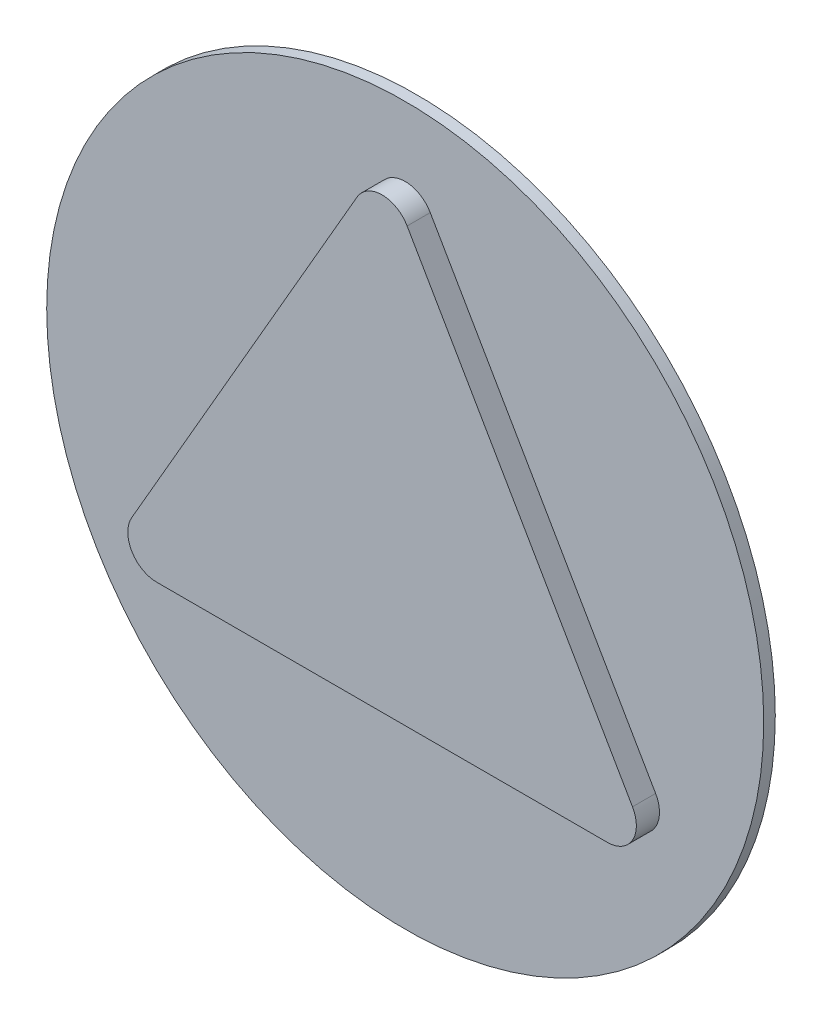
ISO-10303-21;
HEADER;
FILE_DESCRIPTION(('STEP AP214'),'2;1');
FILE_NAME('part.step','',(''),(''),'','','');
FILE_SCHEMA(('AUTOMOTIVE_DESIGN { 1 0 10303 214 1 1 1 1 }'));
ENDSEC;
DATA;
#1=APPLICATION_CONTEXT('core data for automotive mechanical design processes');
#2=APPLICATION_PROTOCOL_DEFINITION('international standard','automotive_design',2000,#1);
#3=PRODUCT_CONTEXT('',#1,'mechanical');
#4=PRODUCT('Part','Part','',(#3));
#5=PRODUCT_RELATED_PRODUCT_CATEGORY('part','',(#4));
#6=PRODUCT_DEFINITION_FORMATION('','',#4);
#7=PRODUCT_DEFINITION_CONTEXT('part definition',#1,'design');
#8=PRODUCT_DEFINITION('design','',#6,#7);
#9=PRODUCT_DEFINITION_SHAPE('','',#8);
#10=(LENGTH_UNIT() NAMED_UNIT(*) SI_UNIT(.MILLI.,.METRE.));
#11=(NAMED_UNIT(*) PLANE_ANGLE_UNIT() SI_UNIT($,.RADIAN.));
#12=(NAMED_UNIT(*) SI_UNIT($,.STERADIAN.) SOLID_ANGLE_UNIT());
#13=UNCERTAINTY_MEASURE_WITH_UNIT(LENGTH_MEASURE(1.E-05),#10,'distance_accuracy_value','');
#14=(GEOMETRIC_REPRESENTATION_CONTEXT(3) GLOBAL_UNCERTAINTY_ASSIGNED_CONTEXT((#13)) GLOBAL_UNIT_ASSIGNED_CONTEXT((#10,
#11,#12)) REPRESENTATION_CONTEXT('',''));
#15=CARTESIAN_POINT('',(0.,0.,0.));
#16=DIRECTION('',(0.,0.,1.));
#17=DIRECTION('',(1.,0.,0.));
#18=AXIS2_PLACEMENT_3D('',#15,#16,#17);
#19=CARTESIAN_POINT('',(0.,0.,0.5));
#20=DIRECTION('',(0.,0.,-1.));
#21=DIRECTION('',(-1.,0.,0.));
#22=AXIS2_PLACEMENT_3D('',#19,#20,#21);
#23=CYLINDRICAL_SURFACE('',#22,15.5);
#24=CARTESIAN_POINT('',(0.,0.,0.5));
#25=DIRECTION('',(0.,0.,1.));
#26=DIRECTION('',(1.,0.,0.));
#27=AXIS2_PLACEMENT_3D('',#24,#25,#26);
#28=CIRCLE('',#27,15.5);
#29=CARTESIAN_POINT('',(15.5,0.,0.5));
#30=VERTEX_POINT('',#29);
#31=EDGE_CURVE('E119',#30,#30,#28,.T.);
#32=ORIENTED_EDGE('',*,*,#31,.F.);
#33=EDGE_LOOP('',(#32));
#34=FACE_BOUND('',#33,.T.);
#35=CARTESIAN_POINT('',(0.,0.,0.));
#36=DIRECTION('',(0.,0.,1.));
#37=DIRECTION('',(1.,0.,0.));
#38=AXIS2_PLACEMENT_3D('',#35,#36,#37);
#39=CIRCLE('',#38,15.5);
#40=CARTESIAN_POINT('',(15.5,0.,0.));
#41=VERTEX_POINT('',#40);
#42=EDGE_CURVE('E122',#41,#41,#39,.T.);
#43=ORIENTED_EDGE('',*,*,#42,.T.);
#44=EDGE_LOOP('',(#43));
#45=FACE_BOUND('',#44,.T.);
#46=ADVANCED_FACE('F35',(#34,#45),#23,.T.);
#47=CARTESIAN_POINT('',(0.,0.,0.5));
#48=DIRECTION('',(0.,0.,1.));
#49=DIRECTION('',(1.,0.,0.));
#50=AXIS2_PLACEMENT_3D('',#47,#48,#49);
#51=PLANE('',#50);
#52=DIRECTION('',(-0.5,-0.866025403784439,0.));
#53=VECTOR('',#52,1.);
#54=CARTESIAN_POINT('',(0.,13.75,0.5));
#55=LINE('',#54,#53);
#56=CARTESIAN_POINT('',(-1.08253175473055,11.875,0.5));
#57=VERTEX_POINT('',#56);
#58=CARTESIAN_POINT('',(-10.8253175473055,-5.,0.5));
#59=VERTEX_POINT('',#58);
#60=EDGE_CURVE('E115',#57,#59,#55,.T.);
#61=ORIENTED_EDGE('',*,*,#60,.F.);
#62=CARTESIAN_POINT('',(0.,11.25,0.5));
#63=DIRECTION('',(0.,0.,1.));
#64=DIRECTION('',(1.,0.,0.));
#65=AXIS2_PLACEMENT_3D('',#62,#63,#64);
#66=CIRCLE('',#65,1.25);
#67=CARTESIAN_POINT('',(1.08253175473054,11.875,0.5));
#68=VERTEX_POINT('',#67);
#69=EDGE_CURVE('E11',#57,#68,#66,.F.);
#70=ORIENTED_EDGE('',*,*,#69,.T.);
#71=DIRECTION('',(-0.5,0.866025403784438,0.));
#72=VECTOR('',#71,1.);
#73=CARTESIAN_POINT('',(11.907849302036,-6.875,0.5));
#74=LINE('',#73,#72);
#75=CARTESIAN_POINT('',(10.8253175473055,-5.,0.5));
#76=VERTEX_POINT('',#75);
#77=EDGE_CURVE('E101',#76,#68,#74,.T.);
#78=ORIENTED_EDGE('',*,*,#77,.F.);
#79=CARTESIAN_POINT('',(9.74278579257494,-5.625,0.5));
#80=DIRECTION('',(0.,0.,1.));
#81=DIRECTION('',(1.,0.,0.));
#82=AXIS2_PLACEMENT_3D('',#79,#80,#81);
#83=CIRCLE('',#82,1.25);
#84=CARTESIAN_POINT('',(9.74278579257493,-6.875,0.5));
#85=VERTEX_POINT('',#84);
#86=EDGE_CURVE('E87',#76,#85,#83,.F.);
#87=ORIENTED_EDGE('',*,*,#86,.T.);
#88=DIRECTION('',(1.,0.,0.));
#89=VECTOR('',#88,1.);
#90=CARTESIAN_POINT('',(-11.907849302036,-6.875,0.5));
#91=LINE('',#90,#89);
#92=CARTESIAN_POINT('',(-9.74278579257493,-6.875,0.5));
#93=VERTEX_POINT('',#92);
#94=EDGE_CURVE('E110',#93,#85,#91,.T.);
#95=ORIENTED_EDGE('',*,*,#94,.F.);
#96=CARTESIAN_POINT('',(-9.74278579257493,-5.625,0.5));
#97=DIRECTION('',(0.,0.,1.));
#98=DIRECTION('',(1.,0.,0.));
#99=AXIS2_PLACEMENT_3D('',#96,#97,#98);
#100=CIRCLE('',#99,1.25);
#101=EDGE_CURVE('E43',#93,#59,#100,.F.);
#102=ORIENTED_EDGE('',*,*,#101,.T.);
#103=EDGE_LOOP('',(#61,#70,#78,#87,#95,#102));
#104=FACE_BOUND('',#103,.T.);
#105=ORIENTED_EDGE('',*,*,#31,.T.);
#106=EDGE_LOOP('',(#105));
#107=FACE_BOUND('',#106,.T.);
#108=ADVANCED_FACE('F107',(#104,#107),#51,.T.);
#109=CARTESIAN_POINT('',(0.,0.,0.));
#110=DIRECTION('',(0.,0.,1.));
#111=DIRECTION('',(1.,0.,0.));
#112=AXIS2_PLACEMENT_3D('',#109,#110,#111);
#113=PLANE('',#112);
#114=ORIENTED_EDGE('',*,*,#42,.F.);
#115=EDGE_LOOP('',(#114));
#116=FACE_BOUND('',#115,.T.);
#117=ADVANCED_FACE('F164',(#116),#113,.F.);
#118=CARTESIAN_POINT('',(0.,13.75,1.5));
#119=DIRECTION('',(0.866025403784439,-0.5,0.));
#120=DIRECTION('',(0.5,0.866025403784439,0.));
#121=AXIS2_PLACEMENT_3D('',#118,#119,#120);
#122=PLANE('',#121);
#123=ORIENTED_EDGE('',*,*,#60,.T.);
#124=DIRECTION('',(0.,0.,-1.));
#125=VECTOR('',#124,1.);
#126=CARTESIAN_POINT('',(-10.8253175473055,-5.,1.5));
#127=LINE('',#126,#125);
#128=CARTESIAN_POINT('',(-10.8253175473055,-5.,1.5));
#129=VERTEX_POINT('',#128);
#130=EDGE_CURVE('E95',#59,#129,#127,.F.);
#131=ORIENTED_EDGE('',*,*,#130,.T.);
#132=DIRECTION('',(-0.5,-0.866025403784439,0.));
#133=VECTOR('',#132,1.);
#134=CARTESIAN_POINT('',(0.,13.75,1.5));
#135=LINE('',#134,#133);
#136=CARTESIAN_POINT('',(-1.08253175473055,11.875,1.5));
#137=VERTEX_POINT('',#136);
#138=EDGE_CURVE('E109',#137,#129,#135,.T.);
#139=ORIENTED_EDGE('',*,*,#138,.F.);
#140=DIRECTION('',(0.,0.,-1.));
#141=VECTOR('',#140,1.);
#142=CARTESIAN_POINT('',(-1.08253175473055,11.875,1.5));
#143=LINE('',#142,#141);
#144=EDGE_CURVE('E135',#137,#57,#143,.T.);
#145=ORIENTED_EDGE('',*,*,#144,.T.);
#146=EDGE_LOOP('',(#123,#131,#139,#145));
#147=FACE_BOUND('',#146,.T.);
#148=ADVANCED_FACE('F140',(#147),#122,.F.);
#149=CARTESIAN_POINT('',(-11.907849302036,-6.875,1.5));
#150=DIRECTION('',(0.,1.,0.));
#151=DIRECTION('',(0.,0.,1.));
#152=AXIS2_PLACEMENT_3D('',#149,#150,#151);
#153=PLANE('',#152);
#154=ORIENTED_EDGE('',*,*,#94,.T.);
#155=DIRECTION('',(0.,0.,-1.));
#156=VECTOR('',#155,1.);
#157=CARTESIAN_POINT('',(9.74278579257494,-6.875,1.5));
#158=LINE('',#157,#156);
#159=CARTESIAN_POINT('',(9.74278579257493,-6.875,1.5));
#160=VERTEX_POINT('',#159);
#161=EDGE_CURVE('E92',#85,#160,#158,.F.);
#162=ORIENTED_EDGE('',*,*,#161,.T.);
#163=DIRECTION('',(1.,0.,0.));
#164=VECTOR('',#163,1.);
#165=CARTESIAN_POINT('',(-11.907849302036,-6.875,1.5));
#166=LINE('',#165,#164);
#167=CARTESIAN_POINT('',(-9.74278579257493,-6.875,1.5));
#168=VERTEX_POINT('',#167);
#169=EDGE_CURVE('E113',#168,#160,#166,.T.);
#170=ORIENTED_EDGE('',*,*,#169,.F.);
#171=DIRECTION('',(0.,0.,-1.));
#172=VECTOR('',#171,1.);
#173=CARTESIAN_POINT('',(-9.74278579257493,-6.875,1.5));
#174=LINE('',#173,#172);
#175=EDGE_CURVE('E104',#168,#93,#174,.T.);
#176=ORIENTED_EDGE('',*,*,#175,.T.);
#177=EDGE_LOOP('',(#154,#162,#170,#176));
#178=FACE_BOUND('',#177,.T.);
#179=ADVANCED_FACE('F151',(#178),#153,.F.);
#180=CARTESIAN_POINT('',(11.907849302036,-6.875,1.5));
#181=DIRECTION('',(-0.866025403784439,-0.5,0.));
#182=DIRECTION('',(0.5,-0.866025403784438,0.));
#183=AXIS2_PLACEMENT_3D('',#180,#181,#182);
#184=PLANE('',#183);
#185=DIRECTION('',(-0.5,0.866025403784438,0.));
#186=VECTOR('',#185,1.);
#187=CARTESIAN_POINT('',(11.907849302036,-6.875,1.5));
#188=LINE('',#187,#186);
#189=CARTESIAN_POINT('',(10.8253175473055,-5.,1.5));
#190=VERTEX_POINT('',#189);
#191=CARTESIAN_POINT('',(1.08253175473054,11.875,1.5));
#192=VERTEX_POINT('',#191);
#193=EDGE_CURVE('E103',#190,#192,#188,.T.);
#194=ORIENTED_EDGE('',*,*,#193,.F.);
#195=DIRECTION('',(0.,0.,-1.));
#196=VECTOR('',#195,1.);
#197=CARTESIAN_POINT('',(10.8253175473055,-5.,1.5));
#198=LINE('',#197,#196);
#199=EDGE_CURVE('E91',#190,#76,#198,.T.);
#200=ORIENTED_EDGE('',*,*,#199,.T.);
#201=ORIENTED_EDGE('',*,*,#77,.T.);
#202=DIRECTION('',(0.,0.,-1.));
#203=VECTOR('',#202,1.);
#204=CARTESIAN_POINT('',(1.08253175473054,11.875,1.5));
#205=LINE('',#204,#203);
#206=EDGE_CURVE('E105',#68,#192,#205,.F.);
#207=ORIENTED_EDGE('',*,*,#206,.T.);
#208=EDGE_LOOP('',(#194,#200,#201,#207));
#209=FACE_BOUND('',#208,.T.);
#210=ADVANCED_FACE('F100',(#209),#184,.F.);
#211=CARTESIAN_POINT('',(0.,0.,1.5));
#212=DIRECTION('',(0.,0.,1.));
#213=DIRECTION('',(1.,0.,0.));
#214=AXIS2_PLACEMENT_3D('',#211,#212,#213);
#215=PLANE('',#214);
#216=ORIENTED_EDGE('',*,*,#169,.T.);
#217=CARTESIAN_POINT('',(9.74278579257494,-5.625,1.5));
#218=DIRECTION('',(0.,0.,1.));
#219=DIRECTION('',(1.,0.,0.));
#220=AXIS2_PLACEMENT_3D('',#217,#218,#219);
#221=CIRCLE('',#220,1.25);
#222=EDGE_CURVE('E133',#160,#190,#221,.T.);
#223=ORIENTED_EDGE('',*,*,#222,.T.);
#224=ORIENTED_EDGE('',*,*,#193,.T.);
#225=CARTESIAN_POINT('',(0.,11.25,1.5));
#226=DIRECTION('',(0.,0.,1.));
#227=DIRECTION('',(1.,0.,0.));
#228=AXIS2_PLACEMENT_3D('',#225,#226,#227);
#229=CIRCLE('',#228,1.25);
#230=EDGE_CURVE('E129',#192,#137,#229,.T.);
#231=ORIENTED_EDGE('',*,*,#230,.T.);
#232=ORIENTED_EDGE('',*,*,#138,.T.);
#233=CARTESIAN_POINT('',(-9.74278579257493,-5.625,1.5));
#234=DIRECTION('',(0.,0.,1.));
#235=DIRECTION('',(1.,0.,0.));
#236=AXIS2_PLACEMENT_3D('',#233,#234,#235);
#237=CIRCLE('',#236,1.25);
#238=EDGE_CURVE('E131',#129,#168,#237,.T.);
#239=ORIENTED_EDGE('',*,*,#238,.T.);
#240=EDGE_LOOP('',(#216,#223,#224,#231,#232,#239));
#241=FACE_BOUND('',#240,.T.);
#242=ADVANCED_FACE('F145',(#241),#215,.T.);
#243=CARTESIAN_POINT('',(9.74278579257494,-5.625,1.5));
#244=DIRECTION('',(0.,0.,-1.));
#245=DIRECTION('',(-1.,0.,0.));
#246=AXIS2_PLACEMENT_3D('',#243,#244,#245);
#247=CYLINDRICAL_SURFACE('',#246,1.25);
#248=ORIENTED_EDGE('',*,*,#222,.F.);
#249=ORIENTED_EDGE('',*,*,#161,.F.);
#250=ORIENTED_EDGE('',*,*,#86,.F.);
#251=ORIENTED_EDGE('',*,*,#199,.F.);
#252=EDGE_LOOP('',(#248,#249,#250,#251));
#253=FACE_BOUND('',#252,.T.);
#254=ADVANCED_FACE('F90',(#253),#247,.T.);
#255=CARTESIAN_POINT('',(-9.74278579257493,-5.625,1.5));
#256=DIRECTION('',(0.,0.,-1.));
#257=DIRECTION('',(-1.,0.,0.));
#258=AXIS2_PLACEMENT_3D('',#255,#256,#257);
#259=CYLINDRICAL_SURFACE('',#258,1.25);
#260=ORIENTED_EDGE('',*,*,#238,.F.);
#261=ORIENTED_EDGE('',*,*,#130,.F.);
#262=ORIENTED_EDGE('',*,*,#101,.F.);
#263=ORIENTED_EDGE('',*,*,#175,.F.);
#264=EDGE_LOOP('',(#260,#261,#262,#263));
#265=FACE_BOUND('',#264,.T.);
#266=ADVANCED_FACE('F149',(#265),#259,.T.);
#267=CARTESIAN_POINT('',(0.,11.25,1.5));
#268=DIRECTION('',(0.,0.,-1.));
#269=DIRECTION('',(-1.,0.,0.));
#270=AXIS2_PLACEMENT_3D('',#267,#268,#269);
#271=CYLINDRICAL_SURFACE('',#270,1.25);
#272=ORIENTED_EDGE('',*,*,#230,.F.);
#273=ORIENTED_EDGE('',*,*,#206,.F.);
#274=ORIENTED_EDGE('',*,*,#69,.F.);
#275=ORIENTED_EDGE('',*,*,#144,.F.);
#276=EDGE_LOOP('',(#272,#273,#274,#275));
#277=FACE_BOUND('',#276,.T.);
#278=ADVANCED_FACE('F37',(#277),#271,.T.);
#279=CLOSED_SHELL('',(#46,#108,#117,#148,#179,#210,#242,#254,#266,#278));
#280=MANIFOLD_SOLID_BREP('B2',#279);
#281=ADVANCED_BREP_SHAPE_REPRESENTATION('',(#18,#280),#14);
#282=SHAPE_DEFINITION_REPRESENTATION(#9,#281);
ENDSEC;
END-ISO-10303-21;
